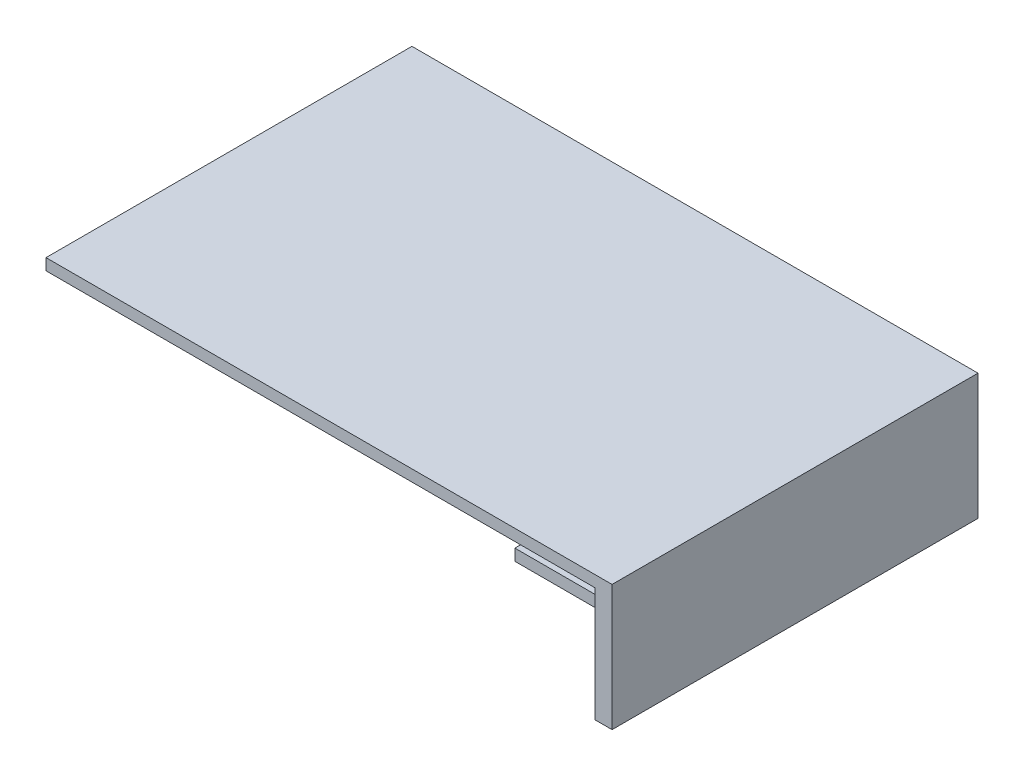
ISO-10303-21;
HEADER;
FILE_DESCRIPTION(('STEP AP214'),'2;1');
FILE_NAME('part.step','',(''),(''),'','','');
FILE_SCHEMA(('AUTOMOTIVE_DESIGN { 1 0 10303 214 1 1 1 1 }'));
ENDSEC;
DATA;
#1=APPLICATION_CONTEXT('core data for automotive mechanical design processes');
#2=APPLICATION_PROTOCOL_DEFINITION('international standard','automotive_design',2000,#1);
#3=PRODUCT_CONTEXT('',#1,'mechanical');
#4=PRODUCT('Part','Part','',(#3));
#5=PRODUCT_RELATED_PRODUCT_CATEGORY('part','',(#4));
#6=PRODUCT_DEFINITION_FORMATION('','',#4);
#7=PRODUCT_DEFINITION_CONTEXT('part definition',#1,'design');
#8=PRODUCT_DEFINITION('design','',#6,#7);
#9=PRODUCT_DEFINITION_SHAPE('','',#8);
#10=(LENGTH_UNIT() NAMED_UNIT(*) SI_UNIT(.MILLI.,.METRE.));
#11=(NAMED_UNIT(*) PLANE_ANGLE_UNIT() SI_UNIT($,.RADIAN.));
#12=(NAMED_UNIT(*) SI_UNIT($,.STERADIAN.) SOLID_ANGLE_UNIT());
#13=UNCERTAINTY_MEASURE_WITH_UNIT(LENGTH_MEASURE(1.E-05),#10,'distance_accuracy_value','');
#14=(GEOMETRIC_REPRESENTATION_CONTEXT(3) GLOBAL_UNCERTAINTY_ASSIGNED_CONTEXT((#13)) GLOBAL_UNIT_ASSIGNED_CONTEXT((#10,
#11,#12)) REPRESENTATION_CONTEXT('',''));
#15=CARTESIAN_POINT('',(0.,0.,0.));
#16=DIRECTION('',(0.,0.,1.));
#17=DIRECTION('',(1.,0.,0.));
#18=AXIS2_PLACEMENT_3D('',#15,#16,#17);
#19=CARTESIAN_POINT('',(80.6630237101728,109.053917659983,58.555970668029));
#20=DIRECTION('',(-1.,0.,0.));
#21=DIRECTION('',(0.,0.,1.));
#22=AXIS2_PLACEMENT_3D('',#19,#20,#21);
#23=PLANE('',#22);
#24=DIRECTION('',(0.,-1.,0.));
#25=VECTOR('',#24,1.);
#26=CARTESIAN_POINT('',(80.6630237101728,-3.77014218573931,55.380970668029));
#27=LINE('',#26,#25);
#28=CARTESIAN_POINT('',(80.6630237101728,-3.77014218573932,55.380970668029));
#29=VERTEX_POINT('',#28);
#30=CARTESIAN_POINT('',(80.6630237101728,-6.94514218573931,55.380970668029));
#31=VERTEX_POINT('',#30);
#32=EDGE_CURVE('E154',#29,#31,#27,.T.);
#33=ORIENTED_EDGE('',*,*,#32,.T.);
#34=DIRECTION('',(0.,0.,-1.));
#35=VECTOR('',#34,1.);
#36=CARTESIAN_POINT('',(80.6630237101728,-6.94514218573931,55.380970668029));
#37=LINE('',#36,#35);
#38=CARTESIAN_POINT('',(80.6630237101728,-6.94514218573931,53.793470668029));
#39=VERTEX_POINT('',#38);
#40=EDGE_CURVE('E156',#31,#39,#37,.T.);
#41=ORIENTED_EDGE('',*,*,#40,.T.);
#42=DIRECTION('',(0.,1.,0.));
#43=VECTOR('',#42,1.);
#44=CARTESIAN_POINT('',(80.6630237101728,-6.94514218573931,53.793470668029));
#45=LINE('',#44,#43);
#46=CARTESIAN_POINT('',(80.6630237101728,-3.77014218573932,53.793470668029));
#47=VERTEX_POINT('',#46);
#48=EDGE_CURVE('E181',#39,#47,#45,.T.);
#49=ORIENTED_EDGE('',*,*,#48,.T.);
#50=DIRECTION('',(0.,0.,1.));
#51=VECTOR('',#50,1.);
#52=CARTESIAN_POINT('',(80.6630237101728,-3.77014218573931,53.793470668029));
#53=LINE('',#52,#51);
#54=EDGE_CURVE('E56',#47,#29,#53,.T.);
#55=ORIENTED_EDGE('',*,*,#54,.T.);
#56=EDGE_LOOP('',(#33,#41,#49,#55));
#57=FACE_BOUND('',#56,.T.);
#58=DIRECTION('',(0.,0.,1.));
#59=VECTOR('',#58,1.);
#60=CARTESIAN_POINT('',(80.6630237101728,0.992357814260686,-43.044029331971));
#61=LINE('',#60,#59);
#62=CARTESIAN_POINT('',(80.6630237101728,0.992357814260686,-43.044029331971));
#63=VERTEX_POINT('',#62);
#64=CARTESIAN_POINT('',(80.6630237101728,0.992357814260686,58.555970668029));
#65=VERTEX_POINT('',#64);
#66=EDGE_CURVE('E186',#63,#65,#61,.T.);
#67=ORIENTED_EDGE('',*,*,#66,.F.);
#68=DIRECTION('',(0.,-1.,0.));
#69=VECTOR('',#68,1.);
#70=CARTESIAN_POINT('',(80.6630237101728,109.053917659983,-43.044029331971));
#71=LINE('',#70,#69);
#72=CARTESIAN_POINT('',(80.6630237101728,-30.7576421857393,-43.044029331971));
#73=VERTEX_POINT('',#72);
#74=EDGE_CURVE('E11',#63,#73,#71,.T.);
#75=ORIENTED_EDGE('',*,*,#74,.T.);
#76=DIRECTION('',(0.,0.,-1.));
#77=VECTOR('',#76,1.);
#78=CARTESIAN_POINT('',(80.6630237101728,-30.7576421857393,58.555970668029));
#79=LINE('',#78,#77);
#80=CARTESIAN_POINT('',(80.6630237101728,-30.7576421857393,58.555970668029));
#81=VERTEX_POINT('',#80);
#82=EDGE_CURVE('E215',#81,#73,#79,.T.);
#83=ORIENTED_EDGE('',*,*,#82,.F.);
#84=DIRECTION('',(0.,-1.,0.));
#85=VECTOR('',#84,1.);
#86=CARTESIAN_POINT('',(80.6630237101728,109.053917659983,58.555970668029));
#87=LINE('',#86,#85);
#88=EDGE_CURVE('E41',#65,#81,#87,.T.);
#89=ORIENTED_EDGE('',*,*,#88,.F.);
#90=EDGE_LOOP('',(#67,#75,#83,#89));
#91=FACE_BOUND('',#90,.T.);
#92=DIRECTION('',(0.,0.,1.));
#93=VECTOR('',#92,1.);
#94=CARTESIAN_POINT('',(80.6630237101728,-6.94514218573931,-39.869029331971));
#95=LINE('',#94,#93);
#96=CARTESIAN_POINT('',(80.6630237101728,-6.94514218573931,-39.869029331971));
#97=VERTEX_POINT('',#96);
#98=CARTESIAN_POINT('',(80.6630237101728,-6.94514218573931,-38.281529331971));
#99=VERTEX_POINT('',#98);
#100=EDGE_CURVE('E153',#97,#99,#95,.T.);
#101=ORIENTED_EDGE('',*,*,#100,.F.);
#102=DIRECTION('',(0.,-1.,0.));
#103=VECTOR('',#102,1.);
#104=CARTESIAN_POINT('',(80.6630237101728,-3.77014218573931,-39.869029331971));
#105=LINE('',#104,#103);
#106=CARTESIAN_POINT('',(80.6630237101728,-3.77014218573931,-39.869029331971));
#107=VERTEX_POINT('',#106);
#108=EDGE_CURVE('E148',#107,#97,#105,.T.);
#109=ORIENTED_EDGE('',*,*,#108,.F.);
#110=DIRECTION('',(0.,0.,-1.));
#111=VECTOR('',#110,1.);
#112=CARTESIAN_POINT('',(80.6630237101728,-3.77014218573931,-38.281529331971));
#113=LINE('',#112,#111);
#114=CARTESIAN_POINT('',(80.6630237101728,-3.77014218573932,-38.281529331971));
#115=VERTEX_POINT('',#114);
#116=EDGE_CURVE('E133',#115,#107,#113,.T.);
#117=ORIENTED_EDGE('',*,*,#116,.F.);
#118=DIRECTION('',(0.,1.,0.));
#119=VECTOR('',#118,1.);
#120=CARTESIAN_POINT('',(80.6630237101728,-6.94514218573931,-38.281529331971));
#121=LINE('',#120,#119);
#122=EDGE_CURVE('E141',#99,#115,#121,.T.);
#123=ORIENTED_EDGE('',*,*,#122,.F.);
#124=EDGE_LOOP('',(#101,#109,#117,#123));
#125=FACE_BOUND('',#124,.T.);
#126=ADVANCED_FACE('F33',(#57,#91,#125),#23,.T.);
#127=CARTESIAN_POINT('',(4.46302371017285,4.16735781426069,7.75597066802902));
#128=DIRECTION('',(0.,1.,0.));
#129=DIRECTION('',(0.,0.,1.));
#130=AXIS2_PLACEMENT_3D('',#127,#128,#129);
#131=PLANE('',#130);
#132=DIRECTION('',(1.,0.,0.));
#133=VECTOR('',#132,1.);
#134=CARTESIAN_POINT('',(80.6630237101728,4.16735781426068,-43.044029331971));
#135=LINE('',#134,#133);
#136=CARTESIAN_POINT('',(-71.7369762898272,4.16735781426068,-43.044029331971));
#137=VERTEX_POINT('',#136);
#138=CARTESIAN_POINT('',(85.4255237101728,4.16735781426068,-43.044029331971));
#139=VERTEX_POINT('',#138);
#140=EDGE_CURVE('E219',#137,#139,#135,.T.);
#141=ORIENTED_EDGE('',*,*,#140,.F.);
#142=DIRECTION('',(0.,0.,-1.));
#143=VECTOR('',#142,1.);
#144=CARTESIAN_POINT('',(-71.7369762898272,4.16735781426068,-43.044029331971));
#145=LINE('',#144,#143);
#146=CARTESIAN_POINT('',(-71.7369762898272,4.16735781426068,58.555970668029));
#147=VERTEX_POINT('',#146);
#148=EDGE_CURVE('E205',#147,#137,#145,.T.);
#149=ORIENTED_EDGE('',*,*,#148,.F.);
#150=DIRECTION('',(-1.,0.,0.));
#151=VECTOR('',#150,1.);
#152=CARTESIAN_POINT('',(85.4255237101728,4.16735781426068,58.555970668029));
#153=LINE('',#152,#151);
#154=CARTESIAN_POINT('',(85.4255237101728,4.16735781426068,58.555970668029));
#155=VERTEX_POINT('',#154);
#156=EDGE_CURVE('E231',#155,#147,#153,.T.);
#157=ORIENTED_EDGE('',*,*,#156,.F.);
#158=DIRECTION('',(0.,0.,1.));
#159=VECTOR('',#158,1.);
#160=CARTESIAN_POINT('',(85.4255237101728,4.16735781426068,-43.044029331971));
#161=LINE('',#160,#159);
#162=EDGE_CURVE('E234',#139,#155,#161,.T.);
#163=ORIENTED_EDGE('',*,*,#162,.F.);
#164=EDGE_LOOP('',(#141,#149,#157,#163));
#165=FACE_BOUND('',#164,.T.);
#166=ADVANCED_FACE('F35',(#165),#131,.T.);
#167=CARTESIAN_POINT('',(0.,-30.7576421857393,0.));
#168=DIRECTION('',(0.,-1.,0.));
#169=DIRECTION('',(0.,0.,-1.));
#170=AXIS2_PLACEMENT_3D('',#167,#168,#169);
#171=PLANE('',#170);
#172=ORIENTED_EDGE('',*,*,#82,.T.);
#173=DIRECTION('',(1.,0.,0.));
#174=VECTOR('',#173,1.);
#175=CARTESIAN_POINT('',(80.6630237101728,-30.7576421857393,-43.044029331971));
#176=LINE('',#175,#174);
#177=CARTESIAN_POINT('',(85.4255237101728,-30.7576421857393,-43.044029331971));
#178=VERTEX_POINT('',#177);
#179=EDGE_CURVE('E223',#73,#178,#176,.T.);
#180=ORIENTED_EDGE('',*,*,#179,.T.);
#181=DIRECTION('',(0.,0.,1.));
#182=VECTOR('',#181,1.);
#183=CARTESIAN_POINT('',(85.4255237101728,-30.7576421857393,-43.044029331971));
#184=LINE('',#183,#182);
#185=CARTESIAN_POINT('',(85.4255237101728,-30.7576421857393,58.555970668029));
#186=VERTEX_POINT('',#185);
#187=EDGE_CURVE('E220',#178,#186,#184,.T.);
#188=ORIENTED_EDGE('',*,*,#187,.T.);
#189=DIRECTION('',(-1.,0.,0.));
#190=VECTOR('',#189,1.);
#191=CARTESIAN_POINT('',(85.4255237101728,-30.7576421857393,58.555970668029));
#192=LINE('',#191,#190);
#193=EDGE_CURVE('E216',#186,#81,#192,.T.);
#194=ORIENTED_EDGE('',*,*,#193,.T.);
#195=EDGE_LOOP('',(#172,#180,#188,#194));
#196=FACE_BOUND('',#195,.T.);
#197=ADVANCED_FACE('F249',(#196),#171,.T.);
#198=CARTESIAN_POINT('',(80.6630237101728,109.053917659983,-43.044029331971));
#199=DIRECTION('',(0.,0.,-1.));
#200=DIRECTION('',(-1.,0.,0.));
#201=AXIS2_PLACEMENT_3D('',#198,#199,#200);
#202=PLANE('',#201);
#203=ORIENTED_EDGE('',*,*,#74,.F.);
#204=DIRECTION('',(1.,0.,0.));
#205=VECTOR('',#204,1.);
#206=CARTESIAN_POINT('',(-173.386573559074,0.992357814260686,-43.044029331971));
#207=LINE('',#206,#205);
#208=CARTESIAN_POINT('',(-71.7369762898272,0.992357814260686,-43.044029331971));
#209=VERTEX_POINT('',#208);
#210=EDGE_CURVE('E199',#209,#63,#207,.T.);
#211=ORIENTED_EDGE('',*,*,#210,.F.);
#212=DIRECTION('',(0.,1.,0.));
#213=VECTOR('',#212,1.);
#214=CARTESIAN_POINT('',(-71.7369762898272,4.16735781426068,-43.044029331971));
#215=LINE('',#214,#213);
#216=EDGE_CURVE('E202',#209,#137,#215,.T.);
#217=ORIENTED_EDGE('',*,*,#216,.T.);
#218=ORIENTED_EDGE('',*,*,#140,.T.);
#219=DIRECTION('',(0.,-1.,0.));
#220=VECTOR('',#219,1.);
#221=CARTESIAN_POINT('',(85.4255237101728,109.053917659983,-43.044029331971));
#222=LINE('',#221,#220);
#223=EDGE_CURVE('E230',#139,#178,#222,.T.);
#224=ORIENTED_EDGE('',*,*,#223,.T.);
#225=ORIENTED_EDGE('',*,*,#179,.F.);
#226=EDGE_LOOP('',(#203,#211,#217,#218,#224,#225));
#227=FACE_BOUND('',#226,.T.);
#228=ADVANCED_FACE('F243',(#227),#202,.T.);
#229=CARTESIAN_POINT('',(85.4255237101728,109.053917659983,-43.044029331971));
#230=DIRECTION('',(1.,0.,0.));
#231=DIRECTION('',(0.,0.,-1.));
#232=AXIS2_PLACEMENT_3D('',#229,#230,#231);
#233=PLANE('',#232);
#234=ORIENTED_EDGE('',*,*,#223,.F.);
#235=ORIENTED_EDGE('',*,*,#162,.T.);
#236=DIRECTION('',(0.,-1.,0.));
#237=VECTOR('',#236,1.);
#238=CARTESIAN_POINT('',(85.4255237101728,109.053917659983,58.555970668029));
#239=LINE('',#238,#237);
#240=EDGE_CURVE('E233',#155,#186,#239,.T.);
#241=ORIENTED_EDGE('',*,*,#240,.T.);
#242=ORIENTED_EDGE('',*,*,#187,.F.);
#243=EDGE_LOOP('',(#234,#235,#241,#242));
#244=FACE_BOUND('',#243,.T.);
#245=ADVANCED_FACE('F245',(#244),#233,.T.);
#246=CARTESIAN_POINT('',(85.4255237101728,109.053917659983,58.555970668029));
#247=DIRECTION('',(0.,0.,1.));
#248=DIRECTION('',(1.,0.,0.));
#249=AXIS2_PLACEMENT_3D('',#246,#247,#248);
#250=PLANE('',#249);
#251=ORIENTED_EDGE('',*,*,#240,.F.);
#252=ORIENTED_EDGE('',*,*,#156,.T.);
#253=DIRECTION('',(0.,1.,0.));
#254=VECTOR('',#253,1.);
#255=CARTESIAN_POINT('',(-71.7369762898272,4.16735781426068,58.555970668029));
#256=LINE('',#255,#254);
#257=CARTESIAN_POINT('',(-71.7369762898272,0.992357814260686,58.555970668029));
#258=VERTEX_POINT('',#257);
#259=EDGE_CURVE('E195',#258,#147,#256,.T.);
#260=ORIENTED_EDGE('',*,*,#259,.F.);
#261=DIRECTION('',(1.,0.,0.));
#262=VECTOR('',#261,1.);
#263=CARTESIAN_POINT('',(-173.386573559074,0.992357814260686,58.555970668029));
#264=LINE('',#263,#262);
#265=EDGE_CURVE('E208',#258,#65,#264,.T.);
#266=ORIENTED_EDGE('',*,*,#265,.T.);
#267=ORIENTED_EDGE('',*,*,#88,.T.);
#268=ORIENTED_EDGE('',*,*,#193,.F.);
#269=EDGE_LOOP('',(#251,#252,#260,#266,#267,#268));
#270=FACE_BOUND('',#269,.T.);
#271=ADVANCED_FACE('F261',(#270),#250,.T.);
#272=CARTESIAN_POINT('',(-173.386573559074,0.992357814260686,-43.044029331971));
#273=DIRECTION('',(0.,1.,0.));
#274=DIRECTION('',(0.,0.,1.));
#275=AXIS2_PLACEMENT_3D('',#272,#273,#274);
#276=PLANE('',#275);
#277=ORIENTED_EDGE('',*,*,#265,.F.);
#278=DIRECTION('',(0.,0.,-1.));
#279=VECTOR('',#278,1.);
#280=CARTESIAN_POINT('',(-71.7369762898272,0.992357814260686,-43.044029331971));
#281=LINE('',#280,#279);
#282=EDGE_CURVE('E198',#258,#209,#281,.T.);
#283=ORIENTED_EDGE('',*,*,#282,.T.);
#284=ORIENTED_EDGE('',*,*,#210,.T.);
#285=ORIENTED_EDGE('',*,*,#66,.T.);
#286=EDGE_LOOP('',(#277,#283,#284,#285));
#287=FACE_BOUND('',#286,.T.);
#288=ADVANCED_FACE('F255',(#287),#276,.F.);
#289=CARTESIAN_POINT('',(-71.7369762898272,0.992357814260686,58.555970668029));
#290=DIRECTION('',(1.,0.,0.));
#291=DIRECTION('',(0.,0.,-1.));
#292=AXIS2_PLACEMENT_3D('',#289,#290,#291);
#293=PLANE('',#292);
#294=ORIENTED_EDGE('',*,*,#282,.F.);
#295=ORIENTED_EDGE('',*,*,#259,.T.);
#296=ORIENTED_EDGE('',*,*,#148,.T.);
#297=ORIENTED_EDGE('',*,*,#216,.F.);
#298=EDGE_LOOP('',(#294,#295,#296,#297));
#299=FACE_BOUND('',#298,.T.);
#300=ADVANCED_FACE('F258',(#299),#293,.F.);
#301=CARTESIAN_POINT('',(55.2630237101728,-3.77014218573931,55.380970668029));
#302=DIRECTION('',(0.,0.,1.));
#303=DIRECTION('',(0.,-1.,0.));
#304=AXIS2_PLACEMENT_3D('',#301,#302,#303);
#305=PLANE('',#304);
#306=ORIENTED_EDGE('',*,*,#32,.F.);
#307=DIRECTION('',(1.,0.,0.));
#308=VECTOR('',#307,1.);
#309=CARTESIAN_POINT('',(55.2630237101728,-3.77014218573931,55.380970668029));
#310=LINE('',#309,#308);
#311=CARTESIAN_POINT('',(55.2630237101728,-3.77014218573931,55.380970668029));
#312=VERTEX_POINT('',#311);
#313=EDGE_CURVE('E184',#312,#29,#310,.T.);
#314=ORIENTED_EDGE('',*,*,#313,.F.);
#315=DIRECTION('',(0.,-1.,0.));
#316=VECTOR('',#315,1.);
#317=CARTESIAN_POINT('',(55.2630237101728,-3.77014218573931,55.380970668029));
#318=LINE('',#317,#316);
#319=CARTESIAN_POINT('',(55.2630237101728,-6.94514218573931,55.380970668029));
#320=VERTEX_POINT('',#319);
#321=EDGE_CURVE('E167',#312,#320,#318,.T.);
#322=ORIENTED_EDGE('',*,*,#321,.T.);
#323=DIRECTION('',(1.,0.,0.));
#324=VECTOR('',#323,1.);
#325=CARTESIAN_POINT('',(55.2630237101728,-6.94514218573931,55.380970668029));
#326=LINE('',#325,#324);
#327=EDGE_CURVE('E178',#320,#31,#326,.T.);
#328=ORIENTED_EDGE('',*,*,#327,.T.);
#329=EDGE_LOOP('',(#306,#314,#322,#328));
#330=FACE_BOUND('',#329,.T.);
#331=ADVANCED_FACE('F301',(#330),#305,.T.);
#332=CARTESIAN_POINT('',(55.2630237101728,-3.77014218573931,53.793470668029));
#333=DIRECTION('',(0.,1.,0.));
#334=DIRECTION('',(0.,0.,1.));
#335=AXIS2_PLACEMENT_3D('',#332,#333,#334);
#336=PLANE('',#335);
#337=ORIENTED_EDGE('',*,*,#54,.F.);
#338=DIRECTION('',(1.,0.,0.));
#339=VECTOR('',#338,1.);
#340=CARTESIAN_POINT('',(55.2630237101728,-3.77014218573931,53.793470668029));
#341=LINE('',#340,#339);
#342=CARTESIAN_POINT('',(55.2630237101728,-3.77014218573931,53.793470668029));
#343=VERTEX_POINT('',#342);
#344=EDGE_CURVE('E187',#343,#47,#341,.T.);
#345=ORIENTED_EDGE('',*,*,#344,.F.);
#346=DIRECTION('',(0.,0.,1.));
#347=VECTOR('',#346,1.);
#348=CARTESIAN_POINT('',(55.2630237101728,-3.77014218573931,53.793470668029));
#349=LINE('',#348,#347);
#350=EDGE_CURVE('E176',#343,#312,#349,.T.);
#351=ORIENTED_EDGE('',*,*,#350,.T.);
#352=ORIENTED_EDGE('',*,*,#313,.T.);
#353=EDGE_LOOP('',(#337,#345,#351,#352));
#354=FACE_BOUND('',#353,.T.);
#355=ADVANCED_FACE('F308',(#354),#336,.T.);
#356=CARTESIAN_POINT('',(55.2630237101728,-6.94514218573931,53.793470668029));
#357=DIRECTION('',(0.,0.,-1.));
#358=DIRECTION('',(-1.,0.,0.));
#359=AXIS2_PLACEMENT_3D('',#356,#357,#358);
#360=PLANE('',#359);
#361=ORIENTED_EDGE('',*,*,#48,.F.);
#362=DIRECTION('',(1.,0.,0.));
#363=VECTOR('',#362,1.);
#364=CARTESIAN_POINT('',(55.2630237101728,-6.94514218573931,53.793470668029));
#365=LINE('',#364,#363);
#366=CARTESIAN_POINT('',(55.2630237101728,-6.94514218573931,53.793470668029));
#367=VERTEX_POINT('',#366);
#368=EDGE_CURVE('E190',#367,#39,#365,.T.);
#369=ORIENTED_EDGE('',*,*,#368,.F.);
#370=DIRECTION('',(0.,1.,0.));
#371=VECTOR('',#370,1.);
#372=CARTESIAN_POINT('',(55.2630237101728,-6.94514218573931,53.793470668029));
#373=LINE('',#372,#371);
#374=EDGE_CURVE('E173',#367,#343,#373,.T.);
#375=ORIENTED_EDGE('',*,*,#374,.T.);
#376=ORIENTED_EDGE('',*,*,#344,.T.);
#377=EDGE_LOOP('',(#361,#369,#375,#376));
#378=FACE_BOUND('',#377,.T.);
#379=ADVANCED_FACE('F316',(#378),#360,.T.);
#380=CARTESIAN_POINT('',(55.2630237101728,-6.94514218573931,55.380970668029));
#381=DIRECTION('',(0.,-1.,0.));
#382=DIRECTION('',(0.,0.,-1.));
#383=AXIS2_PLACEMENT_3D('',#380,#381,#382);
#384=PLANE('',#383);
#385=ORIENTED_EDGE('',*,*,#40,.F.);
#386=ORIENTED_EDGE('',*,*,#327,.F.);
#387=DIRECTION('',(0.,0.,-1.));
#388=VECTOR('',#387,1.);
#389=CARTESIAN_POINT('',(55.2630237101728,-6.94514218573931,55.380970668029));
#390=LINE('',#389,#388);
#391=EDGE_CURVE('E170',#320,#367,#390,.T.);
#392=ORIENTED_EDGE('',*,*,#391,.T.);
#393=ORIENTED_EDGE('',*,*,#368,.T.);
#394=EDGE_LOOP('',(#385,#386,#392,#393));
#395=FACE_BOUND('',#394,.T.);
#396=ADVANCED_FACE('F324',(#395),#384,.T.);
#397=CARTESIAN_POINT('',(55.2630237101728,0.,0.));
#398=DIRECTION('',(1.,0.,0.));
#399=DIRECTION('',(0.,0.,-1.));
#400=AXIS2_PLACEMENT_3D('',#397,#398,#399);
#401=PLANE('',#400);
#402=ORIENTED_EDGE('',*,*,#321,.F.);
#403=ORIENTED_EDGE('',*,*,#350,.F.);
#404=ORIENTED_EDGE('',*,*,#374,.F.);
#405=ORIENTED_EDGE('',*,*,#391,.F.);
#406=EDGE_LOOP('',(#402,#403,#404,#405));
#407=FACE_BOUND('',#406,.T.);
#408=ADVANCED_FACE('F332',(#407),#401,.F.);
#409=CARTESIAN_POINT('',(55.2630237101728,-3.77014218573931,-39.869029331971));
#410=DIRECTION('',(0.,0.,1.));
#411=DIRECTION('',(1.,0.,0.));
#412=AXIS2_PLACEMENT_3D('',#409,#410,#411);
#413=PLANE('',#412);
#414=ORIENTED_EDGE('',*,*,#108,.T.);
#415=DIRECTION('',(1.,0.,0.));
#416=VECTOR('',#415,1.);
#417=CARTESIAN_POINT('',(55.2630237101728,-6.94514218573931,-39.869029331971));
#418=LINE('',#417,#416);
#419=CARTESIAN_POINT('',(55.2630237101728,-6.94514218573931,-39.869029331971));
#420=VERTEX_POINT('',#419);
#421=EDGE_CURVE('E431',#420,#97,#418,.T.);
#422=ORIENTED_EDGE('',*,*,#421,.F.);
#423=DIRECTION('',(0.,-1.,0.));
#424=VECTOR('',#423,1.);
#425=CARTESIAN_POINT('',(55.2630237101728,-3.77014218573931,-39.869029331971));
#426=LINE('',#425,#424);
#427=CARTESIAN_POINT('',(55.2630237101728,-3.77014218573931,-39.869029331971));
#428=VERTEX_POINT('',#427);
#429=EDGE_CURVE('E142',#428,#420,#426,.T.);
#430=ORIENTED_EDGE('',*,*,#429,.F.);
#431=DIRECTION('',(1.,0.,0.));
#432=VECTOR('',#431,1.);
#433=CARTESIAN_POINT('',(55.2630237101728,-3.77014218573931,-39.869029331971));
#434=LINE('',#433,#432);
#435=EDGE_CURVE('E136',#428,#107,#434,.T.);
#436=ORIENTED_EDGE('',*,*,#435,.T.);
#437=EDGE_LOOP('',(#414,#422,#430,#436));
#438=FACE_BOUND('',#437,.T.);
#439=ADVANCED_FACE('F146',(#438),#413,.F.);
#440=CARTESIAN_POINT('',(55.2630237101728,-6.94514218573931,-39.869029331971));
#441=DIRECTION('',(0.,1.,0.));
#442=DIRECTION('',(0.,0.,1.));
#443=AXIS2_PLACEMENT_3D('',#440,#441,#442);
#444=PLANE('',#443);
#445=ORIENTED_EDGE('',*,*,#100,.T.);
#446=DIRECTION('',(1.,0.,0.));
#447=VECTOR('',#446,1.);
#448=CARTESIAN_POINT('',(55.2630237101728,-6.94514218573931,-38.281529331971));
#449=LINE('',#448,#447);
#450=CARTESIAN_POINT('',(55.2630237101728,-6.94514218573931,-38.281529331971));
#451=VERTEX_POINT('',#450);
#452=EDGE_CURVE('E432',#451,#99,#449,.T.);
#453=ORIENTED_EDGE('',*,*,#452,.F.);
#454=DIRECTION('',(0.,0.,1.));
#455=VECTOR('',#454,1.);
#456=CARTESIAN_POINT('',(55.2630237101728,-6.94514218573931,-39.869029331971));
#457=LINE('',#456,#455);
#458=EDGE_CURVE('E164',#420,#451,#457,.T.);
#459=ORIENTED_EDGE('',*,*,#458,.F.);
#460=ORIENTED_EDGE('',*,*,#421,.T.);
#461=EDGE_LOOP('',(#445,#453,#459,#460));
#462=FACE_BOUND('',#461,.T.);
#463=ADVANCED_FACE('F347',(#462),#444,.F.);
#464=CARTESIAN_POINT('',(55.2630237101728,-6.94514218573931,-38.281529331971));
#465=DIRECTION('',(0.,0.,-1.));
#466=DIRECTION('',(-1.,0.,0.));
#467=AXIS2_PLACEMENT_3D('',#464,#465,#466);
#468=PLANE('',#467);
#469=ORIENTED_EDGE('',*,*,#122,.T.);
#470=DIRECTION('',(1.,0.,0.));
#471=VECTOR('',#470,1.);
#472=CARTESIAN_POINT('',(55.2630237101728,-3.77014218573931,-38.281529331971));
#473=LINE('',#472,#471);
#474=CARTESIAN_POINT('',(55.2630237101728,-3.77014218573931,-38.281529331971));
#475=VERTEX_POINT('',#474);
#476=EDGE_CURVE('E48',#475,#115,#473,.T.);
#477=ORIENTED_EDGE('',*,*,#476,.F.);
#478=DIRECTION('',(0.,1.,0.));
#479=VECTOR('',#478,1.);
#480=CARTESIAN_POINT('',(55.2630237101728,-6.94514218573931,-38.281529331971));
#481=LINE('',#480,#479);
#482=EDGE_CURVE('E162',#451,#475,#481,.T.);
#483=ORIENTED_EDGE('',*,*,#482,.F.);
#484=ORIENTED_EDGE('',*,*,#452,.T.);
#485=EDGE_LOOP('',(#469,#477,#483,#484));
#486=FACE_BOUND('',#485,.T.);
#487=ADVANCED_FACE('F354',(#486),#468,.F.);
#488=CARTESIAN_POINT('',(55.2630237101728,-3.77014218573931,-38.281529331971));
#489=DIRECTION('',(0.,-1.,0.));
#490=DIRECTION('',(0.,0.,-1.));
#491=AXIS2_PLACEMENT_3D('',#488,#489,#490);
#492=PLANE('',#491);
#493=ORIENTED_EDGE('',*,*,#116,.T.);
#494=ORIENTED_EDGE('',*,*,#435,.F.);
#495=DIRECTION('',(0.,0.,-1.));
#496=VECTOR('',#495,1.);
#497=CARTESIAN_POINT('',(55.2630237101728,-3.77014218573931,-38.281529331971));
#498=LINE('',#497,#496);
#499=EDGE_CURVE('E151',#475,#428,#498,.T.);
#500=ORIENTED_EDGE('',*,*,#499,.F.);
#501=ORIENTED_EDGE('',*,*,#476,.T.);
#502=EDGE_LOOP('',(#493,#494,#500,#501));
#503=FACE_BOUND('',#502,.T.);
#504=ADVANCED_FACE('F135',(#503),#492,.F.);
#505=CARTESIAN_POINT('',(55.2630237101728,0.,0.));
#506=DIRECTION('',(-1.,0.,0.));
#507=DIRECTION('',(0.,0.,1.));
#508=AXIS2_PLACEMENT_3D('',#505,#506,#507);
#509=PLANE('',#508);
#510=ORIENTED_EDGE('',*,*,#429,.T.);
#511=ORIENTED_EDGE('',*,*,#458,.T.);
#512=ORIENTED_EDGE('',*,*,#482,.T.);
#513=ORIENTED_EDGE('',*,*,#499,.T.);
#514=EDGE_LOOP('',(#510,#511,#512,#513));
#515=FACE_BOUND('',#514,.T.);
#516=ADVANCED_FACE('F369',(#515),#509,.T.);
#517=CLOSED_SHELL('',(#126,#166,#197,#228,#245,#271,#288,#300,#331,#355,#379,#396,#408,#439,
#463,#487,#504,#516));
#518=MANIFOLD_SOLID_BREP('B2',#517);
#519=ADVANCED_BREP_SHAPE_REPRESENTATION('',(#18,#518),#14);
#520=SHAPE_DEFINITION_REPRESENTATION(#9,#519);
ENDSEC;
END-ISO-10303-21;
